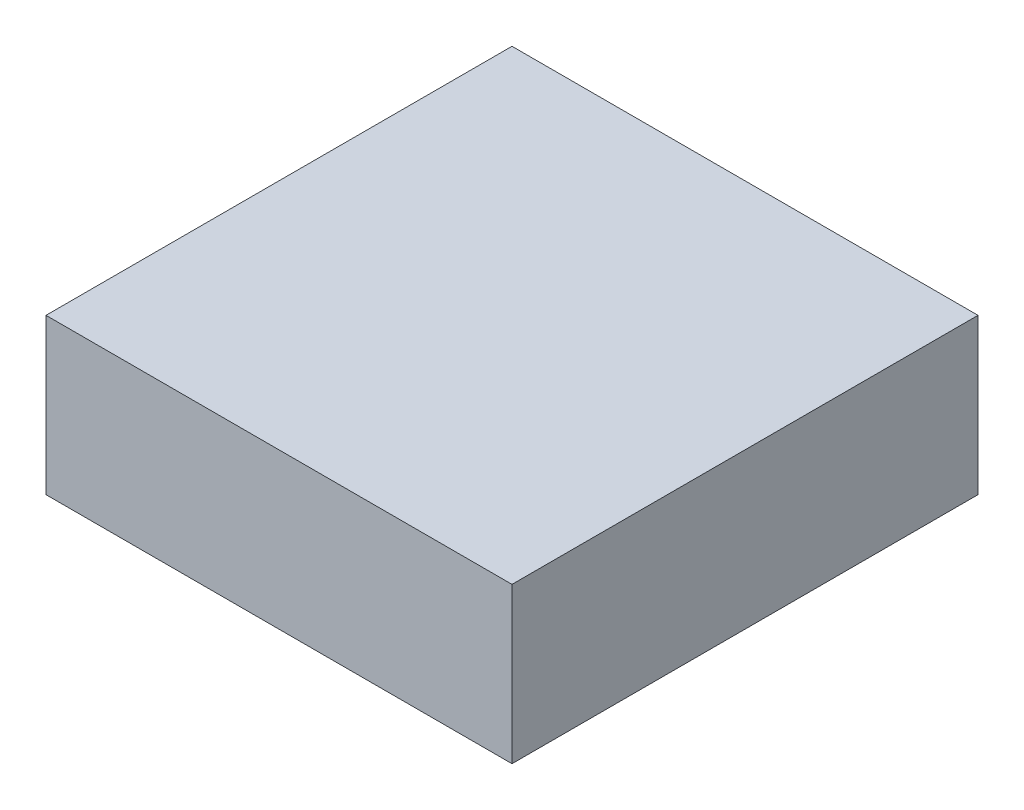
ISO-10303-21;
HEADER;
FILE_DESCRIPTION(('STEP AP214'),'2;1');
FILE_NAME('part.step','',(''),(''),'','','');
FILE_SCHEMA(('AUTOMOTIVE_DESIGN { 1 0 10303 214 1 1 1 1 }'));
ENDSEC;
DATA;
#1=APPLICATION_CONTEXT('core data for automotive mechanical design processes');
#2=APPLICATION_PROTOCOL_DEFINITION('international standard','automotive_design',2000,#1);
#3=PRODUCT_CONTEXT('',#1,'mechanical');
#4=PRODUCT('Part','Part','',(#3));
#5=PRODUCT_RELATED_PRODUCT_CATEGORY('part','',(#4));
#6=PRODUCT_DEFINITION_FORMATION('','',#4);
#7=PRODUCT_DEFINITION_CONTEXT('part definition',#1,'design');
#8=PRODUCT_DEFINITION('design','',#6,#7);
#9=PRODUCT_DEFINITION_SHAPE('','',#8);
#10=(LENGTH_UNIT() NAMED_UNIT(*) SI_UNIT(.MILLI.,.METRE.));
#11=(NAMED_UNIT(*) PLANE_ANGLE_UNIT() SI_UNIT($,.RADIAN.));
#12=(NAMED_UNIT(*) SI_UNIT($,.STERADIAN.) SOLID_ANGLE_UNIT());
#13=UNCERTAINTY_MEASURE_WITH_UNIT(LENGTH_MEASURE(1.E-05),#10,'distance_accuracy_value','');
#14=(GEOMETRIC_REPRESENTATION_CONTEXT(3) GLOBAL_UNCERTAINTY_ASSIGNED_CONTEXT((#13)) GLOBAL_UNIT_ASSIGNED_CONTEXT((#10,
#11,#12)) REPRESENTATION_CONTEXT('',''));
#15=CARTESIAN_POINT('',(0.,0.,0.));
#16=DIRECTION('',(0.,0.,1.));
#17=DIRECTION('',(1.,0.,0.));
#18=AXIS2_PLACEMENT_3D('',#15,#16,#17);
#19=CARTESIAN_POINT('',(-15.,10.,-15.));
#20=DIRECTION('',(1.,0.,0.));
#21=DIRECTION('',(0.,0.,-1.));
#22=AXIS2_PLACEMENT_3D('',#19,#20,#21);
#23=PLANE('',#22);
#24=DIRECTION('',(0.,0.,1.));
#25=VECTOR('',#24,1.);
#26=CARTESIAN_POINT('',(-15.,0.,-15.));
#27=LINE('',#26,#25);
#28=CARTESIAN_POINT('',(-15.,0.,-15.));
#29=VERTEX_POINT('',#28);
#30=CARTESIAN_POINT('',(-15.,0.,15.));
#31=VERTEX_POINT('',#30);
#32=EDGE_CURVE('E97',#29,#31,#27,.T.);
#33=ORIENTED_EDGE('',*,*,#32,.T.);
#34=DIRECTION('',(0.,-1.,0.));
#35=VECTOR('',#34,1.);
#36=CARTESIAN_POINT('',(-15.,10.,15.));
#37=LINE('',#36,#35);
#38=CARTESIAN_POINT('',(-15.,10.,15.));
#39=VERTEX_POINT('',#38);
#40=EDGE_CURVE('E11',#39,#31,#37,.T.);
#41=ORIENTED_EDGE('',*,*,#40,.F.);
#42=DIRECTION('',(0.,0.,1.));
#43=VECTOR('',#42,1.);
#44=CARTESIAN_POINT('',(-15.,10.,-15.));
#45=LINE('',#44,#43);
#46=CARTESIAN_POINT('',(-15.,10.,-15.));
#47=VERTEX_POINT('',#46);
#48=EDGE_CURVE('E85',#47,#39,#45,.T.);
#49=ORIENTED_EDGE('',*,*,#48,.F.);
#50=DIRECTION('',(0.,-1.,0.));
#51=VECTOR('',#50,1.);
#52=CARTESIAN_POINT('',(-15.,10.,-15.));
#53=LINE('',#52,#51);
#54=EDGE_CURVE('E93',#47,#29,#53,.T.);
#55=ORIENTED_EDGE('',*,*,#54,.T.);
#56=EDGE_LOOP('',(#33,#41,#49,#55));
#57=FACE_BOUND('',#56,.T.);
#58=ADVANCED_FACE('F34',(#57),#23,.F.);
#59=CARTESIAN_POINT('',(-15.,10.,15.));
#60=DIRECTION('',(0.,0.,-1.));
#61=DIRECTION('',(-1.,0.,0.));
#62=AXIS2_PLACEMENT_3D('',#59,#60,#61);
#63=PLANE('',#62);
#64=DIRECTION('',(1.,0.,0.));
#65=VECTOR('',#64,1.);
#66=CARTESIAN_POINT('',(-15.,0.,15.));
#67=LINE('',#66,#65);
#68=CARTESIAN_POINT('',(15.,0.,15.));
#69=VERTEX_POINT('',#68);
#70=EDGE_CURVE('E89',#31,#69,#67,.T.);
#71=ORIENTED_EDGE('',*,*,#70,.T.);
#72=DIRECTION('',(0.,-1.,0.));
#73=VECTOR('',#72,1.);
#74=CARTESIAN_POINT('',(15.,10.,15.));
#75=LINE('',#74,#73);
#76=CARTESIAN_POINT('',(15.,10.,15.));
#77=VERTEX_POINT('',#76);
#78=EDGE_CURVE('E42',#77,#69,#75,.T.);
#79=ORIENTED_EDGE('',*,*,#78,.F.);
#80=DIRECTION('',(1.,0.,0.));
#81=VECTOR('',#80,1.);
#82=CARTESIAN_POINT('',(-15.,10.,15.));
#83=LINE('',#82,#81);
#84=EDGE_CURVE('E80',#39,#77,#83,.T.);
#85=ORIENTED_EDGE('',*,*,#84,.F.);
#86=ORIENTED_EDGE('',*,*,#40,.T.);
#87=EDGE_LOOP('',(#71,#79,#85,#86));
#88=FACE_BOUND('',#87,.T.);
#89=ADVANCED_FACE('F88',(#88),#63,.F.);
#90=CARTESIAN_POINT('',(15.,10.,-15.));
#91=DIRECTION('',(-1.,0.,0.));
#92=DIRECTION('',(0.,0.,1.));
#93=AXIS2_PLACEMENT_3D('',#90,#91,#92);
#94=PLANE('',#93);
#95=DIRECTION('',(0.,0.,-1.));
#96=VECTOR('',#95,1.);
#97=CARTESIAN_POINT('',(15.,0.,-15.));
#98=LINE('',#97,#96);
#99=CARTESIAN_POINT('',(15.,0.,-15.));
#100=VERTEX_POINT('',#99);
#101=EDGE_CURVE('E67',#69,#100,#98,.T.);
#102=ORIENTED_EDGE('',*,*,#101,.T.);
#103=DIRECTION('',(0.,-1.,0.));
#104=VECTOR('',#103,1.);
#105=CARTESIAN_POINT('',(15.,10.,-15.));
#106=LINE('',#105,#104);
#107=CARTESIAN_POINT('',(15.,10.,-15.));
#108=VERTEX_POINT('',#107);
#109=EDGE_CURVE('E90',#108,#100,#106,.T.);
#110=ORIENTED_EDGE('',*,*,#109,.F.);
#111=DIRECTION('',(0.,0.,-1.));
#112=VECTOR('',#111,1.);
#113=CARTESIAN_POINT('',(15.,10.,-15.));
#114=LINE('',#113,#112);
#115=EDGE_CURVE('E83',#77,#108,#114,.T.);
#116=ORIENTED_EDGE('',*,*,#115,.F.);
#117=ORIENTED_EDGE('',*,*,#78,.T.);
#118=EDGE_LOOP('',(#102,#110,#116,#117));
#119=FACE_BOUND('',#118,.T.);
#120=ADVANCED_FACE('F91',(#119),#94,.F.);
#121=CARTESIAN_POINT('',(-15.,10.,-15.));
#122=DIRECTION('',(0.,0.,1.));
#123=DIRECTION('',(1.,0.,0.));
#124=AXIS2_PLACEMENT_3D('',#121,#122,#123);
#125=PLANE('',#124);
#126=DIRECTION('',(-1.,0.,0.));
#127=VECTOR('',#126,1.);
#128=CARTESIAN_POINT('',(-15.,0.,-15.));
#129=LINE('',#128,#127);
#130=EDGE_CURVE('E73',#100,#29,#129,.T.);
#131=ORIENTED_EDGE('',*,*,#130,.T.);
#132=ORIENTED_EDGE('',*,*,#54,.F.);
#133=DIRECTION('',(-1.,0.,0.));
#134=VECTOR('',#133,1.);
#135=CARTESIAN_POINT('',(-15.,10.,-15.));
#136=LINE('',#135,#134);
#137=EDGE_CURVE('E50',#108,#47,#136,.T.);
#138=ORIENTED_EDGE('',*,*,#137,.F.);
#139=ORIENTED_EDGE('',*,*,#109,.T.);
#140=EDGE_LOOP('',(#131,#132,#138,#139));
#141=FACE_BOUND('',#140,.T.);
#142=ADVANCED_FACE('F104',(#141),#125,.F.);
#143=CARTESIAN_POINT('',(0.,10.,0.));
#144=DIRECTION('',(0.,1.,0.));
#145=DIRECTION('',(0.,0.,1.));
#146=AXIS2_PLACEMENT_3D('',#143,#144,#145);
#147=PLANE('',#146);
#148=ORIENTED_EDGE('',*,*,#48,.T.);
#149=ORIENTED_EDGE('',*,*,#84,.T.);
#150=ORIENTED_EDGE('',*,*,#115,.T.);
#151=ORIENTED_EDGE('',*,*,#137,.T.);
#152=EDGE_LOOP('',(#148,#149,#150,#151));
#153=FACE_BOUND('',#152,.T.);
#154=ADVANCED_FACE('F81',(#153),#147,.T.);
#155=CARTESIAN_POINT('',(0.,0.,0.));
#156=DIRECTION('',(0.,1.,0.));
#157=DIRECTION('',(0.,0.,1.));
#158=AXIS2_PLACEMENT_3D('',#155,#156,#157);
#159=PLANE('',#158);
#160=ORIENTED_EDGE('',*,*,#32,.F.);
#161=ORIENTED_EDGE('',*,*,#130,.F.);
#162=ORIENTED_EDGE('',*,*,#101,.F.);
#163=ORIENTED_EDGE('',*,*,#70,.F.);
#164=EDGE_LOOP('',(#160,#161,#162,#163));
#165=FACE_BOUND('',#164,.T.);
#166=ADVANCED_FACE('F107',(#165),#159,.F.);
#167=CLOSED_SHELL('',(#58,#89,#120,#142,#154,#166));
#168=MANIFOLD_SOLID_BREP('B2',#167);
#169=ADVANCED_BREP_SHAPE_REPRESENTATION('',(#18,#168),#14);
#170=SHAPE_DEFINITION_REPRESENTATION(#9,#169);
ENDSEC;
END-ISO-10303-21;
